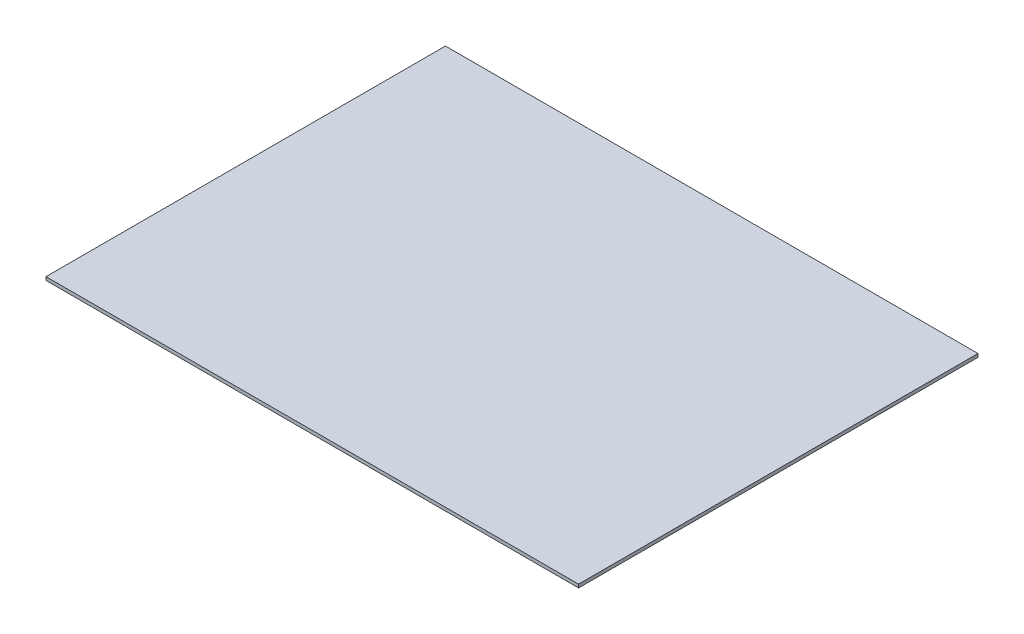
ISO-10303-21;
HEADER;
FILE_DESCRIPTION(('STEP AP214'),'2;1');
FILE_NAME('part.step','',(''),(''),'','','');
FILE_SCHEMA(('AUTOMOTIVE_DESIGN { 1 0 10303 214 1 1 1 1 }'));
ENDSEC;
DATA;
#1=APPLICATION_CONTEXT('core data for automotive mechanical design processes');
#2=APPLICATION_PROTOCOL_DEFINITION('international standard','automotive_design',2000,#1);
#3=PRODUCT_CONTEXT('',#1,'mechanical');
#4=PRODUCT('Part','Part','',(#3));
#5=PRODUCT_RELATED_PRODUCT_CATEGORY('part','',(#4));
#6=PRODUCT_DEFINITION_FORMATION('','',#4);
#7=PRODUCT_DEFINITION_CONTEXT('part definition',#1,'design');
#8=PRODUCT_DEFINITION('design','',#6,#7);
#9=PRODUCT_DEFINITION_SHAPE('','',#8);
#10=(LENGTH_UNIT() NAMED_UNIT(*) SI_UNIT(.MILLI.,.METRE.));
#11=(NAMED_UNIT(*) PLANE_ANGLE_UNIT() SI_UNIT($,.RADIAN.));
#12=(NAMED_UNIT(*) SI_UNIT($,.STERADIAN.) SOLID_ANGLE_UNIT());
#13=UNCERTAINTY_MEASURE_WITH_UNIT(LENGTH_MEASURE(1.E-05),#10,'distance_accuracy_value','');
#14=(GEOMETRIC_REPRESENTATION_CONTEXT(3) GLOBAL_UNCERTAINTY_ASSIGNED_CONTEXT((#13)) GLOBAL_UNIT_ASSIGNED_CONTEXT((#10,
#11,#12)) REPRESENTATION_CONTEXT('',''));
#15=CARTESIAN_POINT('',(0.,0.,0.));
#16=DIRECTION('',(0.,0.,1.));
#17=DIRECTION('',(1.,0.,0.));
#18=AXIS2_PLACEMENT_3D('',#15,#16,#17);
#19=CARTESIAN_POINT('',(400.,5.,300.));
#20=DIRECTION('',(0.,0.,1.));
#21=DIRECTION('',(1.,0.,0.));
#22=AXIS2_PLACEMENT_3D('',#19,#20,#21);
#23=PLANE('',#22);
#24=DIRECTION('',(-1.,0.,0.));
#25=VECTOR('',#24,1.);
#26=CARTESIAN_POINT('',(400.,0.,300.));
#27=LINE('',#26,#25);
#28=CARTESIAN_POINT('',(400.,0.,300.));
#29=VERTEX_POINT('',#28);
#30=CARTESIAN_POINT('',(-400.,0.,300.));
#31=VERTEX_POINT('',#30);
#32=EDGE_CURVE('E97',#29,#31,#27,.T.);
#33=ORIENTED_EDGE('',*,*,#32,.F.);
#34=DIRECTION('',(0.,-1.,0.));
#35=VECTOR('',#34,1.);
#36=CARTESIAN_POINT('',(400.,5.,300.));
#37=LINE('',#36,#35);
#38=CARTESIAN_POINT('',(400.,5.,300.));
#39=VERTEX_POINT('',#38);
#40=EDGE_CURVE('E11',#39,#29,#37,.T.);
#41=ORIENTED_EDGE('',*,*,#40,.F.);
#42=DIRECTION('',(-1.,0.,0.));
#43=VECTOR('',#42,1.);
#44=CARTESIAN_POINT('',(400.,5.,300.));
#45=LINE('',#44,#43);
#46=CARTESIAN_POINT('',(-400.,5.,300.));
#47=VERTEX_POINT('',#46);
#48=EDGE_CURVE('E91',#39,#47,#45,.T.);
#49=ORIENTED_EDGE('',*,*,#48,.T.);
#50=DIRECTION('',(0.,-1.,0.));
#51=VECTOR('',#50,1.);
#52=CARTESIAN_POINT('',(-400.,5.,300.));
#53=LINE('',#52,#51);
#54=EDGE_CURVE('E36',#47,#31,#53,.T.);
#55=ORIENTED_EDGE('',*,*,#54,.T.);
#56=EDGE_LOOP('',(#33,#41,#49,#55));
#57=FACE_BOUND('',#56,.T.);
#58=ADVANCED_FACE('F33',(#57),#23,.T.);
#59=CARTESIAN_POINT('',(400.,5.,-300.));
#60=DIRECTION('',(1.,0.,0.));
#61=DIRECTION('',(0.,0.,-1.));
#62=AXIS2_PLACEMENT_3D('',#59,#60,#61);
#63=PLANE('',#62);
#64=DIRECTION('',(0.,0.,1.));
#65=VECTOR('',#64,1.);
#66=CARTESIAN_POINT('',(400.,0.,-300.));
#67=LINE('',#66,#65);
#68=CARTESIAN_POINT('',(400.,0.,-300.));
#69=VERTEX_POINT('',#68);
#70=EDGE_CURVE('E93',#69,#29,#67,.T.);
#71=ORIENTED_EDGE('',*,*,#70,.F.);
#72=DIRECTION('',(0.,-1.,0.));
#73=VECTOR('',#72,1.);
#74=CARTESIAN_POINT('',(400.,5.,-300.));
#75=LINE('',#74,#73);
#76=CARTESIAN_POINT('',(400.,5.,-300.));
#77=VERTEX_POINT('',#76);
#78=EDGE_CURVE('E42',#77,#69,#75,.T.);
#79=ORIENTED_EDGE('',*,*,#78,.F.);
#80=DIRECTION('',(0.,0.,1.));
#81=VECTOR('',#80,1.);
#82=CARTESIAN_POINT('',(400.,5.,-300.));
#83=LINE('',#82,#81);
#84=EDGE_CURVE('E88',#77,#39,#83,.T.);
#85=ORIENTED_EDGE('',*,*,#84,.T.);
#86=ORIENTED_EDGE('',*,*,#40,.T.);
#87=EDGE_LOOP('',(#71,#79,#85,#86));
#88=FACE_BOUND('',#87,.T.);
#89=ADVANCED_FACE('F107',(#88),#63,.T.);
#90=CARTESIAN_POINT('',(-400.,5.,-300.));
#91=DIRECTION('',(0.,0.,-1.));
#92=DIRECTION('',(-1.,0.,0.));
#93=AXIS2_PLACEMENT_3D('',#90,#91,#92);
#94=PLANE('',#93);
#95=DIRECTION('',(1.,0.,0.));
#96=VECTOR('',#95,1.);
#97=CARTESIAN_POINT('',(-400.,0.,-300.));
#98=LINE('',#97,#96);
#99=CARTESIAN_POINT('',(-400.,0.,-300.));
#100=VERTEX_POINT('',#99);
#101=EDGE_CURVE('E83',#100,#69,#98,.T.);
#102=ORIENTED_EDGE('',*,*,#101,.F.);
#103=DIRECTION('',(0.,-1.,0.));
#104=VECTOR('',#103,1.);
#105=CARTESIAN_POINT('',(-400.,5.,-300.));
#106=LINE('',#105,#104);
#107=CARTESIAN_POINT('',(-400.,5.,-300.));
#108=VERTEX_POINT('',#107);
#109=EDGE_CURVE('E78',#108,#100,#106,.T.);
#110=ORIENTED_EDGE('',*,*,#109,.F.);
#111=DIRECTION('',(1.,0.,0.));
#112=VECTOR('',#111,1.);
#113=CARTESIAN_POINT('',(-400.,5.,-300.));
#114=LINE('',#113,#112);
#115=EDGE_CURVE('E81',#108,#77,#114,.T.);
#116=ORIENTED_EDGE('',*,*,#115,.T.);
#117=ORIENTED_EDGE('',*,*,#78,.T.);
#118=EDGE_LOOP('',(#102,#110,#116,#117));
#119=FACE_BOUND('',#118,.T.);
#120=ADVANCED_FACE('F80',(#119),#94,.T.);
#121=CARTESIAN_POINT('',(-400.,5.,300.));
#122=DIRECTION('',(-1.,0.,0.));
#123=DIRECTION('',(0.,0.,1.));
#124=AXIS2_PLACEMENT_3D('',#121,#122,#123);
#125=PLANE('',#124);
#126=DIRECTION('',(0.,0.,-1.));
#127=VECTOR('',#126,1.);
#128=CARTESIAN_POINT('',(-400.,0.,300.));
#129=LINE('',#128,#127);
#130=EDGE_CURVE('E100',#31,#100,#129,.T.);
#131=ORIENTED_EDGE('',*,*,#130,.F.);
#132=ORIENTED_EDGE('',*,*,#54,.F.);
#133=DIRECTION('',(0.,0.,-1.));
#134=VECTOR('',#133,1.);
#135=CARTESIAN_POINT('',(-400.,5.,300.));
#136=LINE('',#135,#134);
#137=EDGE_CURVE('E87',#47,#108,#136,.T.);
#138=ORIENTED_EDGE('',*,*,#137,.T.);
#139=ORIENTED_EDGE('',*,*,#109,.T.);
#140=EDGE_LOOP('',(#131,#132,#138,#139));
#141=FACE_BOUND('',#140,.T.);
#142=ADVANCED_FACE('F90',(#141),#125,.T.);
#143=CARTESIAN_POINT('',(0.,5.,0.));
#144=DIRECTION('',(0.,-1.,0.));
#145=DIRECTION('',(0.,0.,-1.));
#146=AXIS2_PLACEMENT_3D('',#143,#144,#145);
#147=PLANE('',#146);
#148=ORIENTED_EDGE('',*,*,#48,.F.);
#149=ORIENTED_EDGE('',*,*,#84,.F.);
#150=ORIENTED_EDGE('',*,*,#115,.F.);
#151=ORIENTED_EDGE('',*,*,#137,.F.);
#152=EDGE_LOOP('',(#148,#149,#150,#151));
#153=FACE_BOUND('',#152,.T.);
#154=ADVANCED_FACE('F86',(#153),#147,.F.);
#155=CARTESIAN_POINT('',(0.,0.,0.));
#156=DIRECTION('',(0.,-1.,0.));
#157=DIRECTION('',(0.,0.,-1.));
#158=AXIS2_PLACEMENT_3D('',#155,#156,#157);
#159=PLANE('',#158);
#160=ORIENTED_EDGE('',*,*,#32,.T.);
#161=ORIENTED_EDGE('',*,*,#130,.T.);
#162=ORIENTED_EDGE('',*,*,#101,.T.);
#163=ORIENTED_EDGE('',*,*,#70,.T.);
#164=EDGE_LOOP('',(#160,#161,#162,#163));
#165=FACE_BOUND('',#164,.T.);
#166=ADVANCED_FACE('F106',(#165),#159,.T.);
#167=CLOSED_SHELL('',(#58,#89,#120,#142,#154,#166));
#168=MANIFOLD_SOLID_BREP('B2',#167);
#169=ADVANCED_BREP_SHAPE_REPRESENTATION('',(#18,#168),#14);
#170=SHAPE_DEFINITION_REPRESENTATION(#9,#169);
ENDSEC;
END-ISO-10303-21;
